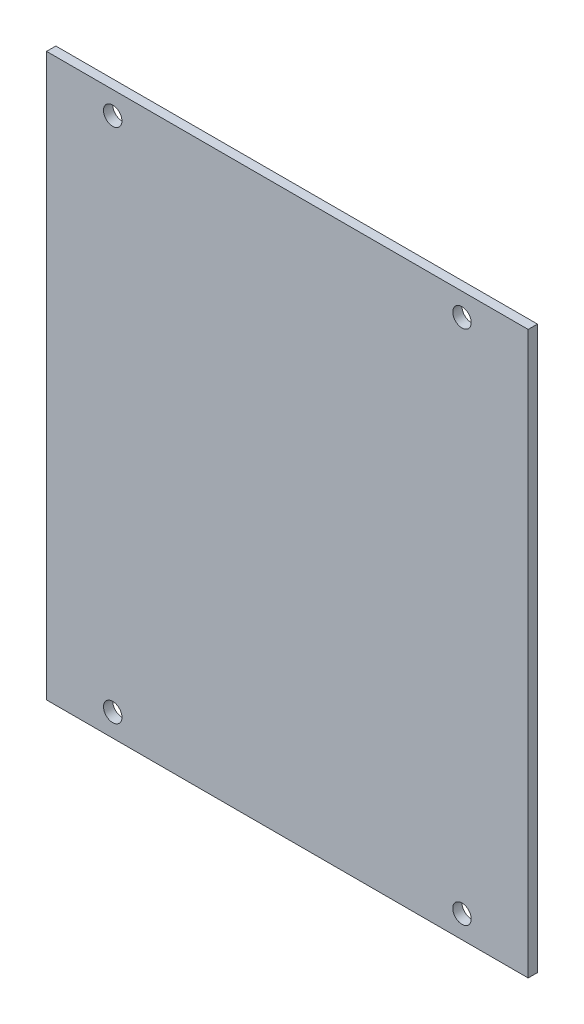
ISO-10303-21;
HEADER;
FILE_DESCRIPTION(('STEP AP214'),'2;1');
FILE_NAME('part.step','',(''),(''),'','','');
FILE_SCHEMA(('AUTOMOTIVE_DESIGN { 1 0 10303 214 1 1 1 1 }'));
ENDSEC;
DATA;
#1=APPLICATION_CONTEXT('core data for automotive mechanical design processes');
#2=APPLICATION_PROTOCOL_DEFINITION('international standard','automotive_design',2000,#1);
#3=PRODUCT_CONTEXT('',#1,'mechanical');
#4=PRODUCT('Part','Part','',(#3));
#5=PRODUCT_RELATED_PRODUCT_CATEGORY('part','',(#4));
#6=PRODUCT_DEFINITION_FORMATION('','',#4);
#7=PRODUCT_DEFINITION_CONTEXT('part definition',#1,'design');
#8=PRODUCT_DEFINITION('design','',#6,#7);
#9=PRODUCT_DEFINITION_SHAPE('','',#8);
#10=(LENGTH_UNIT() NAMED_UNIT(*) SI_UNIT(.MILLI.,.METRE.));
#11=(NAMED_UNIT(*) PLANE_ANGLE_UNIT() SI_UNIT($,.RADIAN.));
#12=(NAMED_UNIT(*) SI_UNIT($,.STERADIAN.) SOLID_ANGLE_UNIT());
#13=UNCERTAINTY_MEASURE_WITH_UNIT(LENGTH_MEASURE(1.E-05),#10,'distance_accuracy_value','');
#14=(GEOMETRIC_REPRESENTATION_CONTEXT(3) GLOBAL_UNCERTAINTY_ASSIGNED_CONTEXT((#13)) GLOBAL_UNIT_ASSIGNED_CONTEXT((#10,
#11,#12)) REPRESENTATION_CONTEXT('',''));
#15=CARTESIAN_POINT('',(0.,0.,0.));
#16=DIRECTION('',(0.,0.,1.));
#17=DIRECTION('',(1.,0.,0.));
#18=AXIS2_PLACEMENT_3D('',#15,#16,#17);
#19=CARTESIAN_POINT('',(0.,0.,51.6));
#20=DIRECTION('',(0.,0.,-1.));
#21=DIRECTION('',(-1.,0.,0.));
#22=AXIS2_PLACEMENT_3D('',#19,#20,#21);
#23=PLANE('',#22);
#24=DIRECTION('',(0.,-1.,0.));
#25=VECTOR('',#24,1.);
#26=CARTESIAN_POINT('',(41.500000000024,8.1,51.6));
#27=LINE('',#26,#25);
#28=CARTESIAN_POINT('',(41.500000000024,104.9,51.6));
#29=VERTEX_POINT('',#28);
#30=CARTESIAN_POINT('',(41.500000000024,8.1,51.6));
#31=VERTEX_POINT('',#30);
#32=EDGE_CURVE('E94',#29,#31,#27,.T.);
#33=ORIENTED_EDGE('',*,*,#32,.F.);
#34=DIRECTION('',(1.,0.,0.));
#35=VECTOR('',#34,1.);
#36=CARTESIAN_POINT('',(50.000000000024,104.9,51.6));
#37=LINE('',#36,#35);
#38=CARTESIAN_POINT('',(-41.500000000024,104.9,51.6));
#39=VERTEX_POINT('',#38);
#40=EDGE_CURVE('E91',#39,#29,#37,.T.);
#41=ORIENTED_EDGE('',*,*,#40,.F.);
#42=DIRECTION('',(0.,1.,0.));
#43=VECTOR('',#42,1.);
#44=CARTESIAN_POINT('',(-41.500000000024,8.09999999999997,51.6));
#45=LINE('',#44,#43);
#46=CARTESIAN_POINT('',(-41.500000000024,8.09999999999999,51.6));
#47=VERTEX_POINT('',#46);
#48=EDGE_CURVE('E84',#47,#39,#45,.T.);
#49=ORIENTED_EDGE('',*,*,#48,.F.);
#50=DIRECTION('',(-1.,0.,0.));
#51=VECTOR('',#50,1.);
#52=CARTESIAN_POINT('',(50.000000000024,8.1,51.6));
#53=LINE('',#52,#51);
#54=EDGE_CURVE('E90',#31,#47,#53,.T.);
#55=ORIENTED_EDGE('',*,*,#54,.F.);
#56=EDGE_LOOP('',(#33,#41,#49,#55));
#57=FACE_BOUND('',#56,.T.);
#58=CARTESIAN_POINT('',(30.095,12.,51.6));
#59=DIRECTION('',(0.,0.,1.));
#60=DIRECTION('',(1.,0.,0.));
#61=AXIS2_PLACEMENT_3D('',#58,#59,#60);
#62=CIRCLE('',#61,1.59000000000001);
#63=CARTESIAN_POINT('',(31.685,12.,51.6));
#64=VERTEX_POINT('',#63);
#65=EDGE_CURVE('E105',#64,#64,#62,.T.);
#66=ORIENTED_EDGE('',*,*,#65,.F.);
#67=EDGE_LOOP('',(#66));
#68=FACE_BOUND('',#67,.T.);
#69=CARTESIAN_POINT('',(30.095,101.,51.6));
#70=DIRECTION('',(0.,0.,1.));
#71=DIRECTION('',(1.,0.,0.));
#72=AXIS2_PLACEMENT_3D('',#69,#70,#71);
#73=CIRCLE('',#72,1.59000000000001);
#74=CARTESIAN_POINT('',(31.685,101.,51.6));
#75=VERTEX_POINT('',#74);
#76=EDGE_CURVE('E164',#75,#75,#73,.T.);
#77=ORIENTED_EDGE('',*,*,#76,.F.);
#78=EDGE_LOOP('',(#77));
#79=FACE_BOUND('',#78,.T.);
#80=CARTESIAN_POINT('',(-30.095,12.,51.6));
#81=DIRECTION('',(0.,0.,1.));
#82=DIRECTION('',(1.,0.,0.));
#83=AXIS2_PLACEMENT_3D('',#80,#81,#82);
#84=CIRCLE('',#83,1.59000000000001);
#85=CARTESIAN_POINT('',(-28.505,12.,51.6));
#86=VERTEX_POINT('',#85);
#87=EDGE_CURVE('E158',#86,#86,#84,.T.);
#88=ORIENTED_EDGE('',*,*,#87,.F.);
#89=EDGE_LOOP('',(#88));
#90=FACE_BOUND('',#89,.T.);
#91=CARTESIAN_POINT('',(-30.095,101.,51.6));
#92=DIRECTION('',(0.,0.,1.));
#93=DIRECTION('',(1.,0.,0.));
#94=AXIS2_PLACEMENT_3D('',#91,#92,#93);
#95=CIRCLE('',#94,1.59000000000001);
#96=CARTESIAN_POINT('',(-28.505,101.,51.6));
#97=VERTEX_POINT('',#96);
#98=EDGE_CURVE('E149',#97,#97,#95,.T.);
#99=ORIENTED_EDGE('',*,*,#98,.F.);
#100=EDGE_LOOP('',(#99));
#101=FACE_BOUND('',#100,.T.);
#102=ADVANCED_FACE('F35',(#57,#68,#79,#90,#101),#23,.F.);
#103=CARTESIAN_POINT('',(0.,0.,50.));
#104=DIRECTION('',(0.,0.,-1.));
#105=DIRECTION('',(-1.,0.,0.));
#106=AXIS2_PLACEMENT_3D('',#103,#104,#105);
#107=PLANE('',#106);
#108=CARTESIAN_POINT('',(-30.095,12.,50.));
#109=DIRECTION('',(0.,0.,1.));
#110=DIRECTION('',(1.,0.,0.));
#111=AXIS2_PLACEMENT_3D('',#108,#109,#110);
#112=CIRCLE('',#111,1.59000000000001);
#113=CARTESIAN_POINT('',(-28.505,12.,50.));
#114=VERTEX_POINT('',#113);
#115=EDGE_CURVE('E155',#114,#114,#112,.T.);
#116=ORIENTED_EDGE('',*,*,#115,.T.);
#117=EDGE_LOOP('',(#116));
#118=FACE_BOUND('',#117,.T.);
#119=CARTESIAN_POINT('',(30.095,12.,50.));
#120=DIRECTION('',(0.,0.,1.));
#121=DIRECTION('',(1.,0.,0.));
#122=AXIS2_PLACEMENT_3D('',#119,#120,#121);
#123=CIRCLE('',#122,1.59000000000001);
#124=CARTESIAN_POINT('',(31.685,12.,50.));
#125=VERTEX_POINT('',#124);
#126=EDGE_CURVE('E167',#125,#125,#123,.T.);
#127=ORIENTED_EDGE('',*,*,#126,.T.);
#128=EDGE_LOOP('',(#127));
#129=FACE_BOUND('',#128,.T.);
#130=DIRECTION('',(0.,-1.,0.));
#131=VECTOR('',#130,1.);
#132=CARTESIAN_POINT('',(41.500000000024,8.1,50.));
#133=LINE('',#132,#131);
#134=CARTESIAN_POINT('',(41.500000000024,104.9,50.));
#135=VERTEX_POINT('',#134);
#136=CARTESIAN_POINT('',(41.500000000024,8.1,50.));
#137=VERTEX_POINT('',#136);
#138=EDGE_CURVE('E101',#135,#137,#133,.T.);
#139=ORIENTED_EDGE('',*,*,#138,.T.);
#140=DIRECTION('',(-1.,0.,0.));
#141=VECTOR('',#140,1.);
#142=CARTESIAN_POINT('',(50.000000000024,8.1,50.));
#143=LINE('',#142,#141);
#144=CARTESIAN_POINT('',(-41.500000000024,8.09999999999999,50.));
#145=VERTEX_POINT('',#144);
#146=EDGE_CURVE('E104',#137,#145,#143,.T.);
#147=ORIENTED_EDGE('',*,*,#146,.T.);
#148=DIRECTION('',(0.,1.,0.));
#149=VECTOR('',#148,1.);
#150=CARTESIAN_POINT('',(-41.500000000024,8.09999999999997,50.));
#151=LINE('',#150,#149);
#152=CARTESIAN_POINT('',(-41.500000000024,104.9,50.));
#153=VERTEX_POINT('',#152);
#154=EDGE_CURVE('E86',#145,#153,#151,.T.);
#155=ORIENTED_EDGE('',*,*,#154,.T.);
#156=DIRECTION('',(1.,0.,0.));
#157=VECTOR('',#156,1.);
#158=CARTESIAN_POINT('',(50.000000000024,104.9,50.));
#159=LINE('',#158,#157);
#160=EDGE_CURVE('E96',#153,#135,#159,.T.);
#161=ORIENTED_EDGE('',*,*,#160,.T.);
#162=EDGE_LOOP('',(#139,#147,#155,#161));
#163=FACE_BOUND('',#162,.T.);
#164=CARTESIAN_POINT('',(30.095,101.,50.));
#165=DIRECTION('',(0.,0.,1.));
#166=DIRECTION('',(1.,0.,0.));
#167=AXIS2_PLACEMENT_3D('',#164,#165,#166);
#168=CIRCLE('',#167,1.59000000000001);
#169=CARTESIAN_POINT('',(31.685,101.,50.));
#170=VERTEX_POINT('',#169);
#171=EDGE_CURVE('E161',#170,#170,#168,.T.);
#172=ORIENTED_EDGE('',*,*,#171,.T.);
#173=EDGE_LOOP('',(#172));
#174=FACE_BOUND('',#173,.T.);
#175=CARTESIAN_POINT('',(-30.095,101.,50.));
#176=DIRECTION('',(0.,0.,1.));
#177=DIRECTION('',(1.,0.,0.));
#178=AXIS2_PLACEMENT_3D('',#175,#176,#177);
#179=CIRCLE('',#178,1.59000000000001);
#180=CARTESIAN_POINT('',(-28.505,101.,50.));
#181=VERTEX_POINT('',#180);
#182=EDGE_CURVE('E152',#181,#181,#179,.T.);
#183=ORIENTED_EDGE('',*,*,#182,.T.);
#184=EDGE_LOOP('',(#183));
#185=FACE_BOUND('',#184,.T.);
#186=ADVANCED_FACE('F111',(#118,#129,#163,#174,#185),#107,.T.);
#187=CARTESIAN_POINT('',(41.500000000024,8.1,51.6));
#188=DIRECTION('',(1.,0.,0.));
#189=DIRECTION('',(0.,0.,-1.));
#190=AXIS2_PLACEMENT_3D('',#187,#188,#189);
#191=PLANE('',#190);
#192=ORIENTED_EDGE('',*,*,#138,.F.);
#193=DIRECTION('',(0.,0.,-1.));
#194=VECTOR('',#193,1.);
#195=CARTESIAN_POINT('',(41.500000000024,104.9,51.6));
#196=LINE('',#195,#194);
#197=EDGE_CURVE('E11',#29,#135,#196,.T.);
#198=ORIENTED_EDGE('',*,*,#197,.F.);
#199=ORIENTED_EDGE('',*,*,#32,.T.);
#200=DIRECTION('',(0.,0.,-1.));
#201=VECTOR('',#200,1.);
#202=CARTESIAN_POINT('',(41.500000000024,8.1,51.6));
#203=LINE('',#202,#201);
#204=EDGE_CURVE('E39',#31,#137,#203,.T.);
#205=ORIENTED_EDGE('',*,*,#204,.T.);
#206=EDGE_LOOP('',(#192,#198,#199,#205));
#207=FACE_BOUND('',#206,.T.);
#208=ADVANCED_FACE('F37',(#207),#191,.T.);
#209=CARTESIAN_POINT('',(50.000000000024,104.9,51.6));
#210=DIRECTION('',(0.,1.,0.));
#211=DIRECTION('',(-1.,0.,0.));
#212=AXIS2_PLACEMENT_3D('',#209,#210,#211);
#213=PLANE('',#212);
#214=ORIENTED_EDGE('',*,*,#160,.F.);
#215=DIRECTION('',(0.,0.,-1.));
#216=VECTOR('',#215,1.);
#217=CARTESIAN_POINT('',(-41.500000000024,104.9,51.6));
#218=LINE('',#217,#216);
#219=EDGE_CURVE('E45',#39,#153,#218,.T.);
#220=ORIENTED_EDGE('',*,*,#219,.F.);
#221=ORIENTED_EDGE('',*,*,#40,.T.);
#222=ORIENTED_EDGE('',*,*,#197,.T.);
#223=EDGE_LOOP('',(#214,#220,#221,#222));
#224=FACE_BOUND('',#223,.T.);
#225=ADVANCED_FACE('F113',(#224),#213,.T.);
#226=CARTESIAN_POINT('',(-41.500000000024,8.09999999999997,51.6));
#227=DIRECTION('',(-1.,0.,0.));
#228=DIRECTION('',(0.,-1.,0.));
#229=AXIS2_PLACEMENT_3D('',#226,#227,#228);
#230=PLANE('',#229);
#231=ORIENTED_EDGE('',*,*,#154,.F.);
#232=DIRECTION('',(0.,0.,-1.));
#233=VECTOR('',#232,1.);
#234=CARTESIAN_POINT('',(-41.500000000024,8.09999999999999,51.6));
#235=LINE('',#234,#233);
#236=EDGE_CURVE('E81',#47,#145,#235,.T.);
#237=ORIENTED_EDGE('',*,*,#236,.F.);
#238=ORIENTED_EDGE('',*,*,#48,.T.);
#239=ORIENTED_EDGE('',*,*,#219,.T.);
#240=EDGE_LOOP('',(#231,#237,#238,#239));
#241=FACE_BOUND('',#240,.T.);
#242=ADVANCED_FACE('F83',(#241),#230,.T.);
#243=CARTESIAN_POINT('',(50.000000000024,8.1,51.6));
#244=DIRECTION('',(0.,-1.,0.));
#245=DIRECTION('',(1.,0.,0.));
#246=AXIS2_PLACEMENT_3D('',#243,#244,#245);
#247=PLANE('',#246);
#248=ORIENTED_EDGE('',*,*,#146,.F.);
#249=ORIENTED_EDGE('',*,*,#204,.F.);
#250=ORIENTED_EDGE('',*,*,#54,.T.);
#251=ORIENTED_EDGE('',*,*,#236,.T.);
#252=EDGE_LOOP('',(#248,#249,#250,#251));
#253=FACE_BOUND('',#252,.T.);
#254=ADVANCED_FACE('F93',(#253),#247,.T.);
#255=CARTESIAN_POINT('',(30.095,12.,51.6));
#256=DIRECTION('',(0.,0.,-1.));
#257=DIRECTION('',(-1.,0.,0.));
#258=AXIS2_PLACEMENT_3D('',#255,#256,#257);
#259=CYLINDRICAL_SURFACE('',#258,1.59000000000001);
#260=ORIENTED_EDGE('',*,*,#65,.T.);
#261=EDGE_LOOP('',(#260));
#262=FACE_BOUND('',#261,.T.);
#263=ORIENTED_EDGE('',*,*,#126,.F.);
#264=EDGE_LOOP('',(#263));
#265=FACE_BOUND('',#264,.T.);
#266=ADVANCED_FACE('F129',(#262,#265),#259,.F.);
#267=CARTESIAN_POINT('',(30.095,101.,51.6));
#268=DIRECTION('',(0.,0.,-1.));
#269=DIRECTION('',(-1.,0.,0.));
#270=AXIS2_PLACEMENT_3D('',#267,#268,#269);
#271=CYLINDRICAL_SURFACE('',#270,1.59000000000001);
#272=ORIENTED_EDGE('',*,*,#76,.T.);
#273=EDGE_LOOP('',(#272));
#274=FACE_BOUND('',#273,.T.);
#275=ORIENTED_EDGE('',*,*,#171,.F.);
#276=EDGE_LOOP('',(#275));
#277=FACE_BOUND('',#276,.T.);
#278=ADVANCED_FACE('F132',(#274,#277),#271,.F.);
#279=CARTESIAN_POINT('',(-30.095,12.,51.6));
#280=DIRECTION('',(0.,0.,-1.));
#281=DIRECTION('',(-1.,0.,0.));
#282=AXIS2_PLACEMENT_3D('',#279,#280,#281);
#283=CYLINDRICAL_SURFACE('',#282,1.59000000000001);
#284=ORIENTED_EDGE('',*,*,#87,.T.);
#285=EDGE_LOOP('',(#284));
#286=FACE_BOUND('',#285,.T.);
#287=ORIENTED_EDGE('',*,*,#115,.F.);
#288=EDGE_LOOP('',(#287));
#289=FACE_BOUND('',#288,.T.);
#290=ADVANCED_FACE('F136',(#286,#289),#283,.F.);
#291=CARTESIAN_POINT('',(-30.095,101.,51.6));
#292=DIRECTION('',(0.,0.,-1.));
#293=DIRECTION('',(-1.,0.,0.));
#294=AXIS2_PLACEMENT_3D('',#291,#292,#293);
#295=CYLINDRICAL_SURFACE('',#294,1.59000000000001);
#296=ORIENTED_EDGE('',*,*,#98,.T.);
#297=EDGE_LOOP('',(#296));
#298=FACE_BOUND('',#297,.T.);
#299=ORIENTED_EDGE('',*,*,#182,.F.);
#300=EDGE_LOOP('',(#299));
#301=FACE_BOUND('',#300,.T.);
#302=ADVANCED_FACE('F140',(#298,#301),#295,.F.);
#303=CLOSED_SHELL('',(#102,#186,#208,#225,#242,#254,#266,#278,#290,#302));
#304=MANIFOLD_SOLID_BREP('B2',#303);
#305=ADVANCED_BREP_SHAPE_REPRESENTATION('',(#18,#304),#14);
#306=SHAPE_DEFINITION_REPRESENTATION(#9,#305);
ENDSEC;
END-ISO-10303-21;
